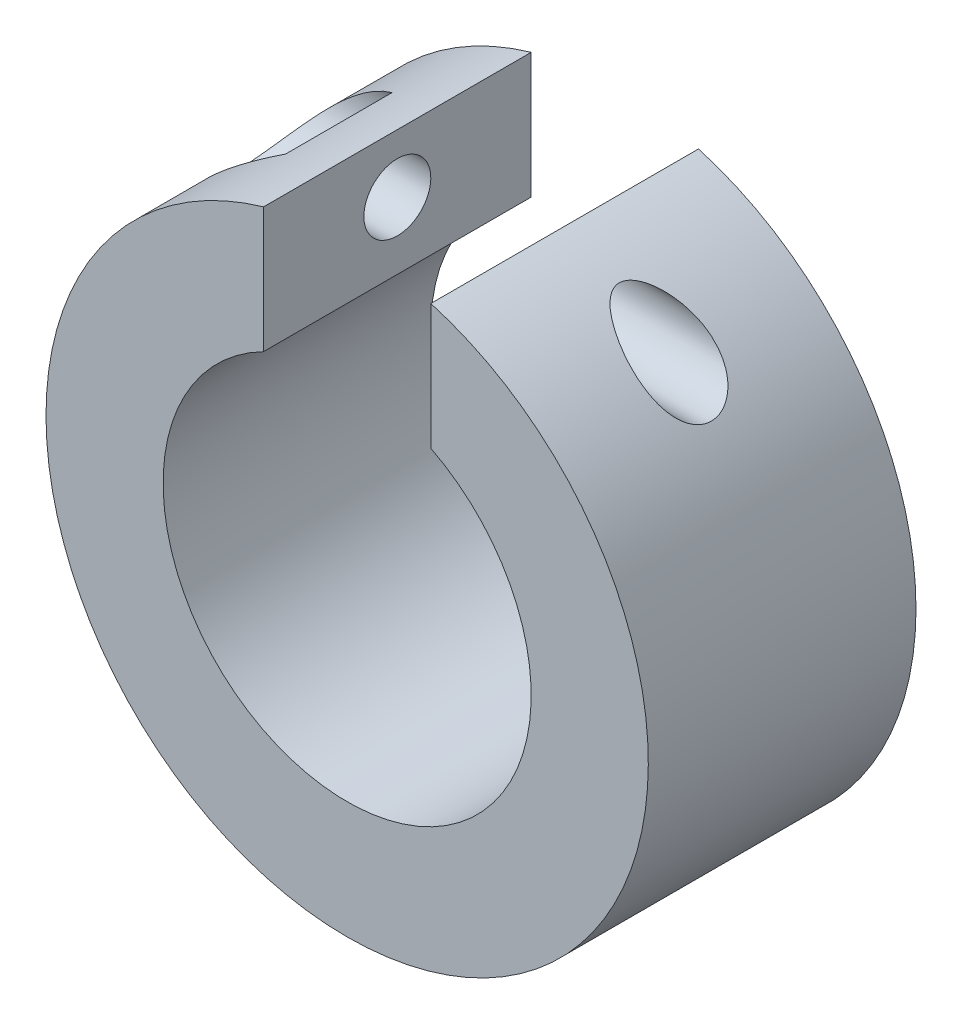
ISO-10303-21;
HEADER;
FILE_DESCRIPTION(('STEP AP214'),'2;1');
FILE_NAME('part.step','',(''),(''),'','','');
FILE_SCHEMA(('AUTOMOTIVE_DESIGN { 1 0 10303 214 1 1 1 1 }'));
ENDSEC;
DATA;
#1=APPLICATION_CONTEXT('core data for automotive mechanical design processes');
#2=APPLICATION_PROTOCOL_DEFINITION('international standard','automotive_design',2000,#1);
#3=PRODUCT_CONTEXT('',#1,'mechanical');
#4=PRODUCT('Part','Part','',(#3));
#5=PRODUCT_RELATED_PRODUCT_CATEGORY('part','',(#4));
#6=PRODUCT_DEFINITION_FORMATION('','',#4);
#7=PRODUCT_DEFINITION_CONTEXT('part definition',#1,'design');
#8=PRODUCT_DEFINITION('design','',#6,#7);
#9=PRODUCT_DEFINITION_SHAPE('','',#8);
#10=(LENGTH_UNIT() NAMED_UNIT(*) SI_UNIT(.MILLI.,.METRE.));
#11=(NAMED_UNIT(*) PLANE_ANGLE_UNIT() SI_UNIT($,.RADIAN.));
#12=(NAMED_UNIT(*) SI_UNIT($,.STERADIAN.) SOLID_ANGLE_UNIT());
#13=UNCERTAINTY_MEASURE_WITH_UNIT(LENGTH_MEASURE(1.E-05),#10,'distance_accuracy_value','');
#14=(GEOMETRIC_REPRESENTATION_CONTEXT(3) GLOBAL_UNCERTAINTY_ASSIGNED_CONTEXT((#13)) GLOBAL_UNIT_ASSIGNED_CONTEXT((#10,
#11,#12)) REPRESENTATION_CONTEXT('',''));
#15=CARTESIAN_POINT('',(0.,0.,0.));
#16=DIRECTION('',(0.,0.,1.));
#17=DIRECTION('',(1.,0.,0.));
#18=AXIS2_PLACEMENT_3D('',#15,#16,#17);
#19=CARTESIAN_POINT('',(0.,0.,8.));
#20=DIRECTION('',(0.,0.,1.));
#21=DIRECTION('',(1.,0.,0.));
#22=AXIS2_PLACEMENT_3D('',#19,#20,#21);
#23=PLANE('',#22);
#24=DIRECTION('',(0.,1.,0.));
#25=VECTOR('',#24,1.);
#26=CARTESIAN_POINT('',(2.5,3.,8.));
#27=LINE('',#26,#25);
#28=CARTESIAN_POINT('',(2.5,4.89897948556636,8.));
#29=VERTEX_POINT('',#28);
#30=CARTESIAN_POINT('',(2.5,8.64580823289529,8.));
#31=VERTEX_POINT('',#30);
#32=EDGE_CURVE('E190',#29,#31,#27,.T.);
#33=ORIENTED_EDGE('',*,*,#32,.F.);
#34=CARTESIAN_POINT('',(0.,0.,8.));
#35=DIRECTION('',(0.,0.,1.));
#36=DIRECTION('',(1.,0.,0.));
#37=AXIS2_PLACEMENT_3D('',#34,#35,#36);
#38=CIRCLE('',#37,5.5);
#39=CARTESIAN_POINT('',(-2.5,4.89897948556636,8.));
#40=VERTEX_POINT('',#39);
#41=EDGE_CURVE('E119',#40,#29,#38,.T.);
#42=ORIENTED_EDGE('',*,*,#41,.F.);
#43=DIRECTION('',(0.,-1.,0.));
#44=VECTOR('',#43,1.);
#45=CARTESIAN_POINT('',(-2.5,3.,8.));
#46=LINE('',#45,#44);
#47=CARTESIAN_POINT('',(-2.5,8.64580823289529,8.));
#48=VERTEX_POINT('',#47);
#49=EDGE_CURVE('E193',#48,#40,#46,.T.);
#50=ORIENTED_EDGE('',*,*,#49,.F.);
#51=CARTESIAN_POINT('',(0.,0.,8.));
#52=DIRECTION('',(0.,0.,1.));
#53=DIRECTION('',(1.,0.,0.));
#54=AXIS2_PLACEMENT_3D('',#51,#52,#53);
#55=CIRCLE('',#54,9.);
#56=EDGE_CURVE('E51',#48,#31,#55,.T.);
#57=ORIENTED_EDGE('',*,*,#56,.T.);
#58=EDGE_LOOP('',(#33,#42,#50,#57));
#59=FACE_BOUND('',#58,.T.);
#60=ADVANCED_FACE('F37',(#59),#23,.T.);
#61=CARTESIAN_POINT('',(0.,0.,0.));
#62=DIRECTION('',(0.,0.,1.));
#63=DIRECTION('',(1.,0.,0.));
#64=AXIS2_PLACEMENT_3D('',#61,#62,#63);
#65=PLANE('',#64);
#66=CARTESIAN_POINT('',(0.,0.,0.));
#67=DIRECTION('',(0.,0.,1.));
#68=DIRECTION('',(1.,0.,0.));
#69=AXIS2_PLACEMENT_3D('',#66,#67,#68);
#70=CIRCLE('',#69,5.5);
#71=CARTESIAN_POINT('',(-2.5,4.89897948556636,0.));
#72=VERTEX_POINT('',#71);
#73=CARTESIAN_POINT('',(2.5,4.89897948556636,0.));
#74=VERTEX_POINT('',#73);
#75=EDGE_CURVE('E127',#72,#74,#70,.T.);
#76=ORIENTED_EDGE('',*,*,#75,.T.);
#77=DIRECTION('',(0.,-1.,0.));
#78=VECTOR('',#77,1.);
#79=CARTESIAN_POINT('',(2.5,3.,0.));
#80=LINE('',#79,#78);
#81=CARTESIAN_POINT('',(2.5,8.64580823289529,0.));
#82=VERTEX_POINT('',#81);
#83=EDGE_CURVE('E65',#82,#74,#80,.T.);
#84=ORIENTED_EDGE('',*,*,#83,.F.);
#85=CARTESIAN_POINT('',(0.,0.,0.));
#86=DIRECTION('',(0.,0.,1.));
#87=DIRECTION('',(1.,0.,0.));
#88=AXIS2_PLACEMENT_3D('',#85,#86,#87);
#89=CIRCLE('',#88,9.);
#90=CARTESIAN_POINT('',(-2.5,8.64580823289529,0.));
#91=VERTEX_POINT('',#90);
#92=EDGE_CURVE('E111',#91,#82,#89,.T.);
#93=ORIENTED_EDGE('',*,*,#92,.F.);
#94=DIRECTION('',(0.,1.,0.));
#95=VECTOR('',#94,1.);
#96=CARTESIAN_POINT('',(-2.5,3.,0.));
#97=LINE('',#96,#95);
#98=EDGE_CURVE('E196',#72,#91,#97,.T.);
#99=ORIENTED_EDGE('',*,*,#98,.F.);
#100=EDGE_LOOP('',(#76,#84,#93,#99));
#101=FACE_BOUND('',#100,.T.);
#102=ADVANCED_FACE('F102',(#101),#65,.F.);
#103=CARTESIAN_POINT('',(0.,0.,8.));
#104=DIRECTION('',(0.,0.,-1.));
#105=DIRECTION('',(-1.,0.,0.));
#106=AXIS2_PLACEMENT_3D('',#103,#104,#105);
#107=CYLINDRICAL_SURFACE('',#106,9.);
#108=DIRECTION('',(0.,0.,-1.));
#109=VECTOR('',#108,1.);
#110=CARTESIAN_POINT('',(-4.25,7.93331582631122,8.));
#111=LINE('',#110,#109);
#112=CARTESIAN_POINT('',(-4.25,7.93331582631122,2.40827829266411));
#113=VERTEX_POINT('',#112);
#114=CARTESIAN_POINT('',(-4.25,7.93331582631122,5.59172170733589));
#115=VERTEX_POINT('',#114);
#116=EDGE_CURVE('E88',#113,#115,#111,.F.);
#117=ORIENTED_EDGE('',*,*,#116,.T.);
#118=CARTESIAN_POINT('',(-4.25,7.93331582631122,5.59172170733589));
#119=CARTESIAN_POINT('',(-4.31740950660555,7.89720338299645,5.61525546786316));
#120=CARTESIAN_POINT('',(-4.38464630729136,7.86007769237717,5.63770855964958));
#121=CARTESIAN_POINT('',(-4.51871039480233,7.78377859171239,5.68030404710916));
#122=CARTESIAN_POINT('',(-4.58553758020224,7.74460469571197,5.70044589076361));
#123=CARTESIAN_POINT('',(-4.78576862801072,7.62369850915061,5.7573086210938));
#124=CARTESIAN_POINT('',(-4.91840601411938,7.53885722046247,5.79028457126569));
#125=CARTESIAN_POINT('',(-5.18258177683045,7.35980215722022,5.84488501525841));
#126=CARTESIAN_POINT('',(-5.3140757697856,7.26546953887571,5.8663365874209));
#127=CARTESIAN_POINT('',(-5.57259808884806,7.06911565181391,5.89467192268834));
#128=CARTESIAN_POINT('',(-5.69963450057328,6.96710948548578,5.90158356329208));
#129=CARTESIAN_POINT('',(-5.88629003074989,6.80869624116314,5.89874359458097));
#130=CARTESIAN_POINT('',(-5.94812231401417,6.75474137989693,5.89555202900327));
#131=CARTESIAN_POINT('',(-6.07003706897036,6.64540209120446,5.88422956452718));
#132=CARTESIAN_POINT('',(-6.13011948484335,6.59001761828119,5.87609850824474));
#133=CARTESIAN_POINT('',(-6.30684483922713,6.42260237783217,5.84362618659225));
#134=CARTESIAN_POINT('',(-6.42056259577659,6.30880241225954,5.81120600571038));
#135=CARTESIAN_POINT('',(-6.61783723258038,6.10090619260425,5.72868074870917));
#136=CARTESIAN_POINT('',(-6.70317700975872,6.00687311632722,5.6827009753321));
#137=CARTESIAN_POINT('',(-6.86429538406974,5.8220614492418,5.57120126913061));
#138=CARTESIAN_POINT('',(-6.94008147358832,5.73128034860839,5.50569678573695));
#139=CARTESIAN_POINT('',(-7.06558155601692,5.57543785346599,5.36933630416665));
#140=CARTESIAN_POINT('',(-7.11747329592104,5.50887667415127,5.30220895303787));
#141=CARTESIAN_POINT('',(-7.21231714361768,5.38410758012203,5.15501128844223));
#142=CARTESIAN_POINT('',(-7.25527249086198,5.32589664082079,5.07494568387177));
#143=CARTESIAN_POINT('',(-7.33128126218419,5.22078293786216,4.9025236578318));
#144=CARTESIAN_POINT('',(-7.36426443442464,5.17396083755089,4.81008636587647));
#145=CARTESIAN_POINT('',(-7.4188702861163,5.09535889642803,4.6158960186723));
#146=CARTESIAN_POINT('',(-7.44049986328381,5.06356992361809,4.51414866385146));
#147=CARTESIAN_POINT('',(-7.4698423517859,5.02016483479859,4.31758069951193));
#148=CARTESIAN_POINT('',(-7.47891257341485,5.00658749632595,4.22339159211169));
#149=CARTESIAN_POINT('',(-7.48750436152911,4.99373070679578,4.03362493357402));
#150=CARTESIAN_POINT('',(-7.48703006990942,4.9944450537805,3.93804800268321));
#151=CARTESIAN_POINT('',(-7.47687876843652,5.00962582191072,3.75449204523211));
#152=CARTESIAN_POINT('',(-7.46777234464646,5.02323956690643,3.66640852065414));
#153=CARTESIAN_POINT('',(-7.44138453757682,5.06224708912592,3.49418583640054));
#154=CARTESIAN_POINT('',(-7.42410375271354,5.08764000403538,3.41004638848836));
#155=CARTESIAN_POINT('',(-7.38141014052579,5.14938878213101,3.24648480040776));
#156=CARTESIAN_POINT('',(-7.35587134448033,5.18591392679109,3.16715995066986));
#157=CARTESIAN_POINT('',(-7.29732113139523,5.26798248948426,3.01635308941203));
#158=CARTESIAN_POINT('',(-7.26430793151153,5.31352805880338,2.94487295511483));
#159=CARTESIAN_POINT('',(-7.18839561599775,5.41584211503997,2.8050831713319));
#160=CARTESIAN_POINT('',(-7.14489431274179,5.4732358129774,2.73756091131484));
#161=CARTESIAN_POINT('',(-7.05088462368924,5.59382614629594,2.61351425772106));
#162=CARTESIAN_POINT('',(-7.00037193846449,5.65702633415544,2.55699666376999));
#163=CARTESIAN_POINT('',(-6.86965770420633,5.81570671104738,2.43233830008074));
#164=CARTESIAN_POINT('',(-6.78619102027754,5.9131249951455,2.37007332397581));
#165=CARTESIAN_POINT('',(-6.6094108536558,6.11009631322425,2.26647923209033));
#166=CARTESIAN_POINT('',(-6.51608231112959,6.20965242160379,2.22518271168945));
#167=CARTESIAN_POINT('',(-6.35146357314038,6.37716591346644,2.17072819411308));
#168=CARTESIAN_POINT('',(-6.28208534407304,6.44553992159843,2.15283372484868));
#169=CARTESIAN_POINT('',(-6.14028935131242,6.58076450212845,2.12503013062497));
#170=CARTESIAN_POINT('',(-6.06787035378799,6.6476144388031,2.11512428074564));
#171=CARTESIAN_POINT('',(-5.84627213269536,6.84545664362676,2.09603336784701));
#172=CARTESIAN_POINT('',(-5.69322593746558,6.97325708265012,2.09761740821669));
#173=CARTESIAN_POINT('',(-5.43324646948258,7.17615809985714,2.11903838416246));
#174=CARTESIAN_POINT('',(-5.32815351184696,7.254504910217,2.13254451233031));
#175=CARTESIAN_POINT('',(-5.11553665266188,7.40596355799286,2.16811822260884));
#176=CARTESIAN_POINT('',(-5.00801116316148,7.47907183789368,2.19019155868954));
#177=CARTESIAN_POINT('',(-4.79267341766183,7.61882816669792,2.24138805595444));
#178=CARTESIAN_POINT('',(-4.68488506268675,7.68555070982143,2.27041098773511));
#179=CARTESIAN_POINT('',(-4.46820468998772,7.81351209918533,2.3347948934482));
#180=CARTESIAN_POINT('',(-4.35931481354218,7.87475990831223,2.37014521267772));
#181=CARTESIAN_POINT('',(-4.25,7.93331582631121,2.40827829266411));
#182=B_SPLINE_CURVE_WITH_KNOTS('',3,(#118,#119,#120,#121,#122,#123,#124,#125,#126,#127,#128,
#129,#130,#131,#132,#133,#134,#135,#136,#137,#138,#139,#140,#141,#142,#143,#144,#145,#146,#147,
#148,#149,#150,#151,#152,#153,#154,#155,#156,#157,#158,#159,#160,#161,#162,#163,#164,#165,#166,
#167,#168,#169,#170,#171,#172,#173,#174,#175,#176,#177,#178,#179,#180,#181),.UNSPECIFIED.,.F.,
.F.,(4,2,2,2,2,2,2,2,2,2,2,2,2,2,2,2,2,2,2,2,2,2,2,2,2,2,2,2,2,2,2,4),(0.,0.240008363289112,
0.48007393140542,0.962037736090535,1.45104452285583,1.93911287622946,2.1853258973208,
2.43154676376261,2.9216577045798,3.32536576118364,3.7287552175843,4.05098008902411,
4.37308794928843,4.69741477684052,5.02154433548504,5.30682378800286,5.59197944457482,
5.85951104544495,6.12702306429535,6.39882515648445,6.67069214913082,6.96569362884235,
7.26087681131415,7.68631309246349,8.11240870329129,8.40913626638172,8.70598541658642,
9.30173658446992,9.69672935753159,10.0919878788408,10.4818569823801,10.8710756570045),.UNSPECIFIED.);
#183=EDGE_CURVE('E11',#115,#113,#182,.T.);
#184=ORIENTED_EDGE('',*,*,#183,.T.);
#185=EDGE_LOOP('',(#117,#184));
#186=FACE_BOUND('',#185,.T.);
#187=CARTESIAN_POINT('',(5.78340979138895,6.89580823289529,2.9));
#188=CARTESIAN_POINT('',(5.88083452271568,6.81409643881078,2.89999249247949));
#189=CARTESIAN_POINT('',(5.97659784296182,6.73024461515641,2.90904238838923));
#190=CARTESIAN_POINT('',(6.16193522512788,6.56095608055027,2.94862610735954));
#191=CARTESIAN_POINT('',(6.25153072587554,6.47552632117294,2.97908090722135));
#192=CARTESIAN_POINT('',(6.38670337320344,6.34154216741613,3.04817863264489));
#193=CARTESIAN_POINT('',(6.43549067773419,6.2919767389511,3.07860105322291));
#194=CARTESIAN_POINT('',(6.52831142432687,6.19561050311734,3.14953332020673));
#195=CARTESIAN_POINT('',(6.57234971916442,6.14880689616365,3.19003272671688));
#196=CARTESIAN_POINT('',(6.64645243599648,6.06853273363707,3.27315471791584));
#197=CARTESIAN_POINT('',(6.67759217217792,6.03420191727836,3.31397929837705));
#198=CARTESIAN_POINT('',(6.73457974205922,5.97053233864158,3.40264546806173));
#199=CARTESIAN_POINT('',(6.76043355042642,5.9411879466333,3.45047902885116));
#200=CARTESIAN_POINT('',(6.80197819745266,5.89354975398941,3.54417916269381));
#201=CARTESIAN_POINT('',(6.8186389437489,5.87423414142405,3.58909346878031));
#202=CARTESIAN_POINT('',(6.84674965777859,5.84144570957096,3.68256102576321));
#203=CARTESIAN_POINT('',(6.8582018808189,5.82797036154958,3.73111269104434));
#204=CARTESIAN_POINT('',(6.87537554149713,5.80770113711601,3.83082186015131));
#205=CARTESIAN_POINT('',(6.88107143348697,5.80093704655456,3.88198993021369));
#206=CARTESIAN_POINT('',(6.88632572160293,5.79469901361268,3.98508129471599));
#207=CARTESIAN_POINT('',(6.88588555027206,5.79522336965043,4.03700441005318));
#208=CARTESIAN_POINT('',(6.87917076221374,5.80319141684802,4.13585865280775));
#209=CARTESIAN_POINT('',(6.87334869513368,5.81009839482673,4.18286596047378));
#210=CARTESIAN_POINT('',(6.85678236412618,5.82963962210525,4.27475740147834));
#211=CARTESIAN_POINT('',(6.84603812246435,5.84227384549766,4.31964154442005));
#212=CARTESIAN_POINT('',(6.8196976049705,5.87300110401307,4.40755013688348));
#213=CARTESIAN_POINT('',(6.80396946285653,5.89124203520427,4.45048270372095));
#214=CARTESIAN_POINT('',(6.76836878619323,5.93210920103453,4.53233568761671));
#215=CARTESIAN_POINT('',(6.7484941333215,5.95473767671352,4.57125403869233));
#216=CARTESIAN_POINT('',(6.69652581680844,6.01320280021486,4.65940213678796));
#217=CARTESIAN_POINT('',(6.66272470224809,6.050701882964,4.70652832425189));
#218=CARTESIAN_POINT('',(6.58968595312175,6.13016885297185,4.79197034006236));
#219=CARTESIAN_POINT('',(6.55043823047294,6.17214499836155,4.8302694605592));
#220=CARTESIAN_POINT('',(6.4530384332235,6.27414064340654,4.91055487534819));
#221=CARTESIAN_POINT('',(6.39313074194622,6.33526338284778,4.94899931778781));
#222=CARTESIAN_POINT('',(6.26799540247783,6.4591058842762,5.0119948342342));
#223=CARTESIAN_POINT('',(6.20275965416183,6.52182797428553,5.03652428628832));
#224=CARTESIAN_POINT('',(6.04088941217119,6.67265730586534,5.08105974511354));
#225=CARTESIAN_POINT('',(5.94240758644006,6.76055821757279,5.09502115579339));
#226=CARTESIAN_POINT('',(5.74121984556602,6.93224465230499,5.10275861491247));
#227=CARTESIAN_POINT('',(5.63850699499221,7.01602288074693,5.09650010447137));
#228=CARTESIAN_POINT('',(5.42772429443821,7.18040415476927,5.06593735109923));
#229=CARTESIAN_POINT('',(5.3195887868521,7.26081581464347,5.04105384336791));
#230=CARTESIAN_POINT('',(5.15770253800899,7.37580586991916,4.99062888192938));
#231=CARTESIAN_POINT('',(5.10380404857159,7.41319106136772,4.97164238914561));
#232=CARTESIAN_POINT('',(4.99642584824018,7.48598193709679,4.92923070695047));
#233=CARTESIAN_POINT('',(4.9429460086869,7.52138825185321,4.90580694182781));
#234=CARTESIAN_POINT('',(4.82169926608255,7.59985594968535,4.84697453658456));
#235=CARTESIAN_POINT('',(4.75420737368279,7.64222088822183,4.81005304973848));
#236=CARTESIAN_POINT('',(4.62204663259977,7.72286488596698,4.72754062963082));
#237=CARTESIAN_POINT('',(4.5573761912691,7.76114626836203,4.68195466720986));
#238=CARTESIAN_POINT('',(4.45344363114696,7.82107529413095,4.59637723936086));
#239=CARTESIAN_POINT('',(4.41265799127434,7.84413315287077,4.55924119531212));
#240=CARTESIAN_POINT('',(4.33543564542864,7.88707334292894,4.47902202334212));
#241=CARTESIAN_POINT('',(4.29899007468449,7.90696217622927,4.43595141936857));
#242=CARTESIAN_POINT('',(4.24590467766546,7.93554266534139,4.36042572531502));
#243=CARTESIAN_POINT('',(4.22698721535941,7.94562434139129,4.33011616653893));
#244=CARTESIAN_POINT('',(4.19321030753685,7.96350114309509,4.26667154016815));
#245=CARTESIAN_POINT('',(4.17834447694942,7.97129986796442,4.23354102761648));
#246=CARTESIAN_POINT('',(4.15634683053075,7.98278820281275,4.17113024711959));
#247=CARTESIAN_POINT('',(4.14829298071572,7.98697110100243,4.1422716672177));
#248=CARTESIAN_POINT('',(4.13659507038933,7.99303609547625,4.08344057527463));
#249=CARTESIAN_POINT('',(4.13294619720648,7.9949207027885,4.05346931587851));
#250=CARTESIAN_POINT('',(4.13046815965836,7.99620130821429,3.99317145210946));
#251=CARTESIAN_POINT('',(4.13165442185148,7.9955893409707,3.96284401868355));
#252=CARTESIAN_POINT('',(4.13873496527085,7.99192639593823,3.90289356747253));
#253=CARTESIAN_POINT('',(4.14463314228543,7.98887339991682,3.87327115347289));
#254=CARTESIAN_POINT('',(4.16230890178588,7.97968060708814,3.80894483344153));
#255=CARTESIAN_POINT('',(4.17511405874258,7.97299908344492,3.77460572214747));
#256=CARTESIAN_POINT('',(4.20537607405981,7.95707891810506,3.70869099345305));
#257=CARTESIAN_POINT('',(4.22284278989391,7.94783485596509,3.67712142280043));
#258=CARTESIAN_POINT('',(4.27285940369924,7.92110367430549,3.5982255810627));
#259=CARTESIAN_POINT('',(4.30807883408211,7.90204354474402,3.55315033496039));
#260=CARTESIAN_POINT('',(4.38352148337776,7.86044623378921,3.46927183740251));
#261=CARTESIAN_POINT('',(4.42375828049589,7.83789957565984,3.43048628888283));
#262=CARTESIAN_POINT('',(4.50492824230536,7.7915138363336,3.36017143108183));
#263=CARTESIAN_POINT('',(4.54570034637406,7.76781481070757,3.32835974809283));
#264=CARTESIAN_POINT('',(4.62899287076788,7.71846958494739,3.26875015825637));
#265=CARTESIAN_POINT('',(4.67151471757001,7.69282178105405,3.24095561313665));
#266=CARTESIAN_POINT('',(4.75775620315109,7.63978562659057,3.18890206269639));
#267=CARTESIAN_POINT('',(4.80147805072209,7.61239392413085,3.16465018040625));
#268=CARTESIAN_POINT('',(4.88963858962794,7.55606869623275,3.11945510625807));
#269=CARTESIAN_POINT('',(4.93407746850845,7.52713476269833,3.09851279603031));
#270=CARTESIAN_POINT('',(5.04570290232728,7.45300864557626,3.05007707085153));
#271=CARTESIAN_POINT('',(5.11315340022607,7.40692092281403,3.02454379743151));
#272=CARTESIAN_POINT('',(5.24827176947234,7.31180417359983,2.98034478014977));
#273=CARTESIAN_POINT('',(5.31593974178444,7.26277350655599,2.96168290900148));
#274=CARTESIAN_POINT('',(5.45086591277884,7.16206257572734,2.93141583138455));
#275=CARTESIAN_POINT('',(5.51812423090305,7.11038313012856,2.91980845991397));
#276=CARTESIAN_POINT('',(5.65164166031089,7.00472685628362,2.90410515719217));
#277=CARTESIAN_POINT('',(5.71790130699079,6.95075132296118,2.90000504806412));
#278=CARTESIAN_POINT('',(5.78340979138895,6.89580823289529,2.9));
#279=B_SPLINE_CURVE_WITH_KNOTS('',3,(#187,#188,#189,#190,#191,#192,#193,#194,#195,#196,#197,
#198,#199,#200,#201,#202,#203,#204,#205,#206,#207,#208,#209,#210,#211,#212,#213,#214,#215,#216,
#217,#218,#219,#220,#221,#222,#223,#224,#225,#226,#227,#228,#229,#230,#231,#232,#233,#234,#235,
#236,#237,#238,#239,#240,#241,#242,#243,#244,#245,#246,#247,#248,#249,#250,#251,#252,#253,#254,
#255,#256,#257,#258,#259,#260,#261,#262,#263,#264,#265,#266,#267,#268,#269,#270,#271,#272,#273,
#274,#275,#276,#277,#278),.UNSPECIFIED.,.T.,.F.,(4,2,2,2,2,2,2,2,2,2,2,2,2,2,2,2,2,2,2,2,2,2,2,
2,2,2,2,2,2,2,2,2,2,2,2,2,2,2,2,2,2,2,2,2,2,4),(0.,0.381217811137894,0.76103557478002,
0.988082209404056,1.21489459293217,1.39949381142026,1.58388321022394,1.73819014093777,
1.8924301925064,2.04735176933098,2.20223717832379,2.34517836772201,2.4881189105276,
2.63521126015235,2.78237893946307,2.98842204166322,3.19485199621547,3.47477634006489,
3.75513446414307,4.15119505391182,4.5479329285542,4.9575510426077,5.16227814849293,
5.36693965147685,5.62996660628687,5.89284311459489,6.07184866909729,6.25048208720533,
6.36155875019726,6.47245933891892,6.56284211186491,6.65312604719043,6.74369825962414,
6.83434543432241,6.94548124364488,7.05685395223132,7.23672567843295,7.41709519844672,
7.58750768906466,7.75806197314926,7.92895459543846,8.09989266501231,8.35630115118688,
8.61285392845275,8.86932793073343,9.12565915888405),.UNSPECIFIED.);
#280=CARTESIAN_POINT('',(5.78340979138895,6.89580823289529,2.9));
#281=VERTEX_POINT('',#280);
#282=EDGE_CURVE('E106',#281,#281,#279,.T.);
#283=ORIENTED_EDGE('',*,*,#282,.T.);
#284=EDGE_LOOP('',(#283));
#285=FACE_BOUND('',#284,.T.);
#286=ORIENTED_EDGE('',*,*,#92,.T.);
#287=DIRECTION('',(0.,0.,-1.));
#288=VECTOR('',#287,1.);
#289=CARTESIAN_POINT('',(2.5,8.64580823289529,8.));
#290=LINE('',#289,#288);
#291=EDGE_CURVE('E113',#31,#82,#290,.T.);
#292=ORIENTED_EDGE('',*,*,#291,.F.);
#293=ORIENTED_EDGE('',*,*,#56,.F.);
#294=DIRECTION('',(0.,0.,-1.));
#295=VECTOR('',#294,1.);
#296=CARTESIAN_POINT('',(-2.5,8.64580823289529,8.));
#297=LINE('',#296,#295);
#298=EDGE_CURVE('E115',#91,#48,#297,.F.);
#299=ORIENTED_EDGE('',*,*,#298,.F.);
#300=EDGE_LOOP('',(#286,#292,#293,#299));
#301=FACE_BOUND('',#300,.T.);
#302=ADVANCED_FACE('F39',(#186,#285,#301),#107,.T.);
#303=CARTESIAN_POINT('',(0.,0.,8.));
#304=DIRECTION('',(0.,0.,-1.));
#305=DIRECTION('',(-1.,0.,0.));
#306=AXIS2_PLACEMENT_3D('',#303,#304,#305);
#307=CYLINDRICAL_SURFACE('',#306,5.5);
#308=DIRECTION('',(0.,0.,-1.));
#309=VECTOR('',#308,1.);
#310=CARTESIAN_POINT('',(2.5,4.89897948556636,8.));
#311=LINE('',#310,#309);
#312=EDGE_CURVE('E182',#29,#74,#311,.T.);
#313=ORIENTED_EDGE('',*,*,#312,.T.);
#314=ORIENTED_EDGE('',*,*,#75,.F.);
#315=DIRECTION('',(0.,0.,-1.));
#316=VECTOR('',#315,1.);
#317=CARTESIAN_POINT('',(-2.5,4.89897948556636,8.));
#318=LINE('',#317,#316);
#319=EDGE_CURVE('E179',#72,#40,#318,.F.);
#320=ORIENTED_EDGE('',*,*,#319,.T.);
#321=ORIENTED_EDGE('',*,*,#41,.T.);
#322=EDGE_LOOP('',(#313,#314,#320,#321));
#323=FACE_BOUND('',#322,.T.);
#324=ADVANCED_FACE('F101',(#323),#307,.F.);
#325=CARTESIAN_POINT('',(-2.5,3.,-0.000999999999999265));
#326=DIRECTION('',(-1.,0.,0.));
#327=DIRECTION('',(0.,-1.,0.));
#328=AXIS2_PLACEMENT_3D('',#325,#326,#327);
#329=PLANE('',#328);
#330=CARTESIAN_POINT('',(-2.5,6.89580823289529,4.));
#331=DIRECTION('',(1.,0.,0.));
#332=DIRECTION('',(0.,1.,0.));
#333=AXIS2_PLACEMENT_3D('',#330,#331,#332);
#334=CIRCLE('',#333,1.);
#335=CARTESIAN_POINT('',(-2.5,7.89580823289529,4.));
#336=VERTEX_POINT('',#335);
#337=EDGE_CURVE('E175',#336,#336,#334,.T.);
#338=ORIENTED_EDGE('',*,*,#337,.F.);
#339=EDGE_LOOP('',(#338));
#340=FACE_BOUND('',#339,.T.);
#341=ORIENTED_EDGE('',*,*,#298,.T.);
#342=ORIENTED_EDGE('',*,*,#49,.T.);
#343=ORIENTED_EDGE('',*,*,#319,.F.);
#344=ORIENTED_EDGE('',*,*,#98,.T.);
#345=EDGE_LOOP('',(#341,#342,#343,#344));
#346=FACE_BOUND('',#345,.T.);
#347=ADVANCED_FACE('F154',(#340,#346),#329,.F.);
#348=CARTESIAN_POINT('',(2.5,3.,-0.000999999999999265));
#349=DIRECTION('',(1.,0.,0.));
#350=DIRECTION('',(0.,1.,0.));
#351=AXIS2_PLACEMENT_3D('',#348,#349,#350);
#352=PLANE('',#351);
#353=CARTESIAN_POINT('',(2.5,6.89580823289529,4.));
#354=DIRECTION('',(1.,0.,0.));
#355=DIRECTION('',(0.,1.,0.));
#356=AXIS2_PLACEMENT_3D('',#353,#354,#355);
#357=CIRCLE('',#356,1.1);
#358=CARTESIAN_POINT('',(2.5,7.99580823289529,4.));
#359=VERTEX_POINT('',#358);
#360=EDGE_CURVE('E92',#359,#359,#357,.T.);
#361=ORIENTED_EDGE('',*,*,#360,.T.);
#362=EDGE_LOOP('',(#361));
#363=FACE_BOUND('',#362,.T.);
#364=ORIENTED_EDGE('',*,*,#291,.T.);
#365=ORIENTED_EDGE('',*,*,#83,.T.);
#366=ORIENTED_EDGE('',*,*,#312,.F.);
#367=ORIENTED_EDGE('',*,*,#32,.T.);
#368=EDGE_LOOP('',(#364,#365,#366,#367));
#369=FACE_BOUND('',#368,.T.);
#370=ADVANCED_FACE('F156',(#363,#369),#352,.F.);
#371=CARTESIAN_POINT('',(-9.001,6.89580823289529,4.));
#372=DIRECTION('',(1.,0.,0.));
#373=DIRECTION('',(0.,1.,0.));
#374=AXIS2_PLACEMENT_3D('',#371,#372,#373);
#375=CYLINDRICAL_SURFACE('',#374,1.);
#376=CARTESIAN_POINT('',(-4.25,6.89580823289529,4.));
#377=DIRECTION('',(1.,0.,0.));
#378=DIRECTION('',(0.,1.,0.));
#379=AXIS2_PLACEMENT_3D('',#376,#377,#378);
#380=CIRCLE('',#379,1.);
#381=CARTESIAN_POINT('',(-4.25,7.89580823289529,4.));
#382=VERTEX_POINT('',#381);
#383=EDGE_CURVE('E93',#382,#382,#380,.F.);
#384=ORIENTED_EDGE('',*,*,#383,.T.);
#385=EDGE_LOOP('',(#384));
#386=FACE_BOUND('',#385,.T.);
#387=ORIENTED_EDGE('',*,*,#337,.T.);
#388=EDGE_LOOP('',(#387));
#389=FACE_BOUND('',#388,.T.);
#390=ADVANCED_FACE('F135',(#386,#389),#375,.F.);
#391=CARTESIAN_POINT('',(7.,6.89580823289529,4.));
#392=DIRECTION('',(1.,0.,0.));
#393=DIRECTION('',(0.,0.,-1.));
#394=AXIS2_PLACEMENT_3D('',#391,#392,#393);
#395=CYLINDRICAL_SURFACE('',#394,1.1);
#396=ORIENTED_EDGE('',*,*,#360,.F.);
#397=EDGE_LOOP('',(#396));
#398=FACE_BOUND('',#397,.T.);
#399=ORIENTED_EDGE('',*,*,#282,.F.);
#400=EDGE_LOOP('',(#399));
#401=FACE_BOUND('',#400,.T.);
#402=ADVANCED_FACE('F143',(#398,#401),#395,.F.);
#403=CARTESIAN_POINT('',(-9.75,6.89580823289529,4.));
#404=DIRECTION('',(1.,0.,0.));
#405=DIRECTION('',(0.,1.,0.));
#406=AXIS2_PLACEMENT_3D('',#403,#404,#405);
#407=CYLINDRICAL_SURFACE('',#406,1.9);
#408=CARTESIAN_POINT('',(-4.25,6.89580823289529,4.));
#409=DIRECTION('',(1.,0.,0.));
#410=DIRECTION('',(0.,1.,0.));
#411=AXIS2_PLACEMENT_3D('',#408,#409,#410);
#412=CIRCLE('',#411,1.9);
#413=EDGE_CURVE('E57',#115,#113,#412,.T.);
#414=ORIENTED_EDGE('',*,*,#413,.T.);
#415=ORIENTED_EDGE('',*,*,#183,.F.);
#416=EDGE_LOOP('',(#414,#415));
#417=FACE_BOUND('',#416,.T.);
#418=ADVANCED_FACE('F96',(#417),#407,.F.);
#419=CARTESIAN_POINT('',(-4.25,6.89580823289529,4.));
#420=DIRECTION('',(1.,0.,0.));
#421=DIRECTION('',(0.,1.,0.));
#422=AXIS2_PLACEMENT_3D('',#419,#420,#421);
#423=PLANE('',#422);
#424=ORIENTED_EDGE('',*,*,#383,.F.);
#425=EDGE_LOOP('',(#424));
#426=FACE_BOUND('',#425,.T.);
#427=ORIENTED_EDGE('',*,*,#413,.F.);
#428=ORIENTED_EDGE('',*,*,#116,.F.);
#429=EDGE_LOOP('',(#427,#428));
#430=FACE_BOUND('',#429,.T.);
#431=ADVANCED_FACE('F89',(#426,#430),#423,.F.);
#432=CLOSED_SHELL('',(#60,#102,#302,#324,#347,#370,#390,#402,#418,#431));
#433=MANIFOLD_SOLID_BREP('B2',#432);
#434=ADVANCED_BREP_SHAPE_REPRESENTATION('',(#18,#433),#14);
#435=SHAPE_DEFINITION_REPRESENTATION(#9,#434);
ENDSEC;
END-ISO-10303-21;
